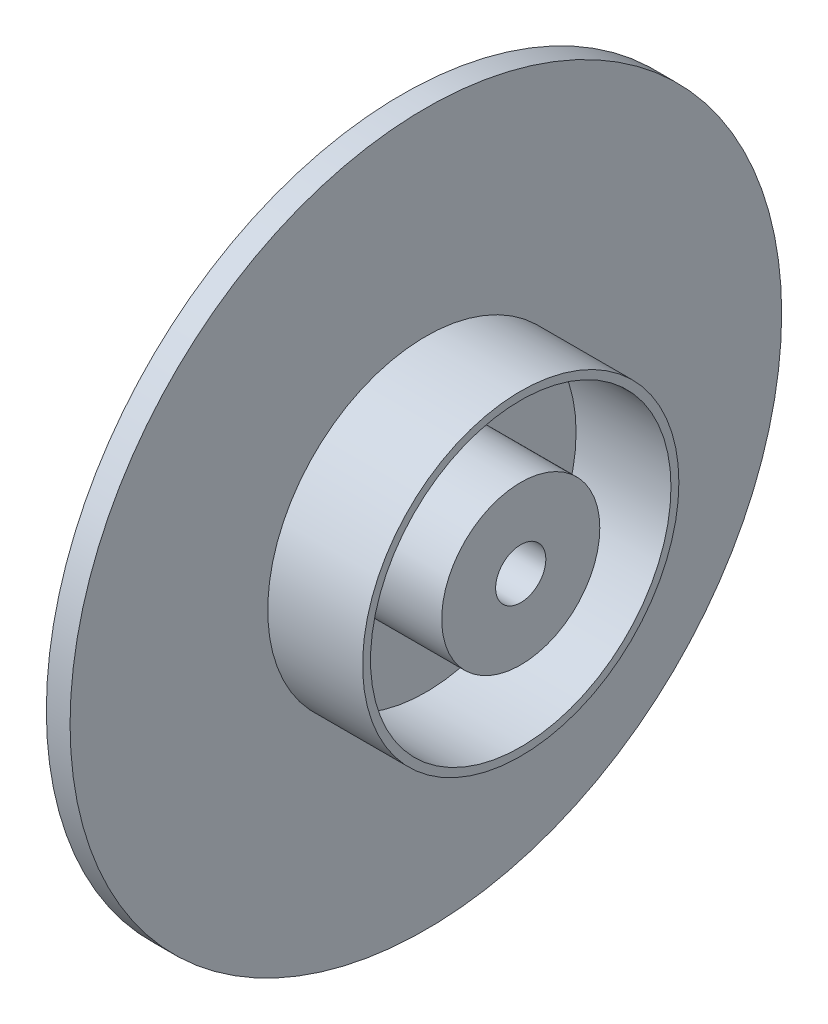
ISO-10303-21;
HEADER;
FILE_DESCRIPTION(('STEP AP214'),'2;1');
FILE_NAME('part.step','',(''),(''),'','','');
FILE_SCHEMA(('AUTOMOTIVE_DESIGN { 1 0 10303 214 1 1 1 1 }'));
ENDSEC;
DATA;
#1=APPLICATION_CONTEXT('core data for automotive mechanical design processes');
#2=APPLICATION_PROTOCOL_DEFINITION('international standard','automotive_design',2000,#1);
#3=PRODUCT_CONTEXT('',#1,'mechanical');
#4=PRODUCT('Part','Part','',(#3));
#5=PRODUCT_RELATED_PRODUCT_CATEGORY('part','',(#4));
#6=PRODUCT_DEFINITION_FORMATION('','',#4);
#7=PRODUCT_DEFINITION_CONTEXT('part definition',#1,'design');
#8=PRODUCT_DEFINITION('design','',#6,#7);
#9=PRODUCT_DEFINITION_SHAPE('','',#8);
#10=(LENGTH_UNIT() NAMED_UNIT(*) SI_UNIT(.MILLI.,.METRE.));
#11=(NAMED_UNIT(*) PLANE_ANGLE_UNIT() SI_UNIT($,.RADIAN.));
#12=(NAMED_UNIT(*) SI_UNIT($,.STERADIAN.) SOLID_ANGLE_UNIT());
#13=UNCERTAINTY_MEASURE_WITH_UNIT(LENGTH_MEASURE(1.E-05),#10,'distance_accuracy_value','');
#14=(GEOMETRIC_REPRESENTATION_CONTEXT(3) GLOBAL_UNCERTAINTY_ASSIGNED_CONTEXT((#13)) GLOBAL_UNIT_ASSIGNED_CONTEXT((#10,
#11,#12)) REPRESENTATION_CONTEXT('',''));
#15=CARTESIAN_POINT('',(0.,0.,0.));
#16=DIRECTION('',(0.,0.,1.));
#17=DIRECTION('',(1.,0.,0.));
#18=AXIS2_PLACEMENT_3D('',#15,#16,#17);
#19=CARTESIAN_POINT('',(3.01133107184446,0.,0.));
#20=DIRECTION('',(-1.,0.,0.));
#21=DIRECTION('',(0.,0.,1.));
#22=AXIS2_PLACEMENT_3D('',#19,#20,#21);
#23=CYLINDRICAL_SURFACE('',#22,27.);
#24=CARTESIAN_POINT('',(3.01133107184446,0.,0.));
#25=DIRECTION('',(1.,0.,0.));
#26=DIRECTION('',(0.,0.,-1.));
#27=AXIS2_PLACEMENT_3D('',#24,#25,#26);
#28=CIRCLE('',#27,27.);
#29=CARTESIAN_POINT('',(3.01133107184446,0.,-27.));
#30=VERTEX_POINT('',#29);
#31=EDGE_CURVE('E45',#30,#30,#28,.T.);
#32=ORIENTED_EDGE('',*,*,#31,.F.);
#33=EDGE_LOOP('',(#32));
#34=FACE_BOUND('',#33,.T.);
#35=CARTESIAN_POINT('',(1.21133107184446,0.,0.));
#36=DIRECTION('',(1.,0.,0.));
#37=DIRECTION('',(0.,0.,-1.));
#38=AXIS2_PLACEMENT_3D('',#35,#36,#37);
#39=CIRCLE('',#38,27.);
#40=CARTESIAN_POINT('',(1.21133107184446,0.,-27.));
#41=VERTEX_POINT('',#40);
#42=EDGE_CURVE('E51',#41,#41,#39,.T.);
#43=ORIENTED_EDGE('',*,*,#42,.T.);
#44=EDGE_LOOP('',(#43));
#45=FACE_BOUND('',#44,.T.);
#46=ADVANCED_FACE('F38',(#34,#45),#23,.T.);
#47=CARTESIAN_POINT('',(3.01133107184446,0.,0.));
#48=DIRECTION('',(1.,0.,0.));
#49=DIRECTION('',(0.,0.,-1.));
#50=AXIS2_PLACEMENT_3D('',#47,#48,#49);
#51=PLANE('',#50);
#52=CARTESIAN_POINT('',(3.01133107184446,0.,0.));
#53=DIRECTION('',(1.,0.,0.));
#54=DIRECTION('',(0.,0.,-1.));
#55=AXIS2_PLACEMENT_3D('',#52,#53,#54);
#56=CIRCLE('',#55,12.);
#57=CARTESIAN_POINT('',(3.01133107184446,0.,-12.));
#58=VERTEX_POINT('',#57);
#59=EDGE_CURVE('E66',#58,#58,#56,.T.);
#60=ORIENTED_EDGE('',*,*,#59,.F.);
#61=EDGE_LOOP('',(#60));
#62=FACE_BOUND('',#61,.T.);
#63=ORIENTED_EDGE('',*,*,#31,.T.);
#64=EDGE_LOOP('',(#63));
#65=FACE_BOUND('',#64,.T.);
#66=ADVANCED_FACE('F112',(#62,#65),#51,.T.);
#67=CARTESIAN_POINT('',(1.21133107184446,0.,0.));
#68=DIRECTION('',(1.,0.,0.));
#69=DIRECTION('',(0.,0.,-1.));
#70=AXIS2_PLACEMENT_3D('',#67,#68,#69);
#71=PLANE('',#70);
#72=CARTESIAN_POINT('',(1.21133107184446,0.,0.));
#73=DIRECTION('',(1.,0.,0.));
#74=DIRECTION('',(0.,0.,-1.));
#75=AXIS2_PLACEMENT_3D('',#72,#73,#74);
#76=CIRCLE('',#75,1.905);
#77=CARTESIAN_POINT('',(1.21133107184446,0.,-1.905));
#78=VERTEX_POINT('',#77);
#79=EDGE_CURVE('E77',#78,#78,#76,.T.);
#80=ORIENTED_EDGE('',*,*,#79,.T.);
#81=EDGE_LOOP('',(#80));
#82=FACE_BOUND('',#81,.T.);
#83=ORIENTED_EDGE('',*,*,#42,.F.);
#84=EDGE_LOOP('',(#83));
#85=FACE_BOUND('',#84,.T.);
#86=ADVANCED_FACE('F86',(#82,#85),#71,.F.);
#87=CARTESIAN_POINT('',(10.2113310718445,0.,0.));
#88=DIRECTION('',(1.,0.,0.));
#89=DIRECTION('',(0.,0.,-1.));
#90=AXIS2_PLACEMENT_3D('',#87,#88,#89);
#91=PLANE('',#90);
#92=CARTESIAN_POINT('',(10.2113310718445,0.,0.));
#93=DIRECTION('',(1.,0.,0.));
#94=DIRECTION('',(0.,0.,-1.));
#95=AXIS2_PLACEMENT_3D('',#92,#93,#94);
#96=CIRCLE('',#95,12.);
#97=CARTESIAN_POINT('',(10.2113310718445,0.,-12.));
#98=VERTEX_POINT('',#97);
#99=EDGE_CURVE('E63',#98,#98,#96,.T.);
#100=ORIENTED_EDGE('',*,*,#99,.T.);
#101=EDGE_LOOP('',(#100));
#102=FACE_BOUND('',#101,.T.);
#103=CARTESIAN_POINT('',(10.2113310718445,0.,0.));
#104=DIRECTION('',(1.,0.,0.));
#105=DIRECTION('',(0.,0.,-1.));
#106=AXIS2_PLACEMENT_3D('',#103,#104,#105);
#107=CIRCLE('',#106,11.4);
#108=CARTESIAN_POINT('',(10.2113310718445,0.,-11.4));
#109=VERTEX_POINT('',#108);
#110=EDGE_CURVE('E70',#109,#109,#107,.T.);
#111=ORIENTED_EDGE('',*,*,#110,.F.);
#112=EDGE_LOOP('',(#111));
#113=FACE_BOUND('',#112,.T.);
#114=ADVANCED_FACE('F124',(#102,#113),#91,.T.);
#115=CARTESIAN_POINT('',(10.2113310718445,0.,0.));
#116=DIRECTION('',(-1.,0.,0.));
#117=DIRECTION('',(0.,0.,1.));
#118=AXIS2_PLACEMENT_3D('',#115,#116,#117);
#119=CYLINDRICAL_SURFACE('',#118,12.);
#120=ORIENTED_EDGE('',*,*,#99,.F.);
#121=EDGE_LOOP('',(#120));
#122=FACE_BOUND('',#121,.T.);
#123=ORIENTED_EDGE('',*,*,#59,.T.);
#124=EDGE_LOOP('',(#123));
#125=FACE_BOUND('',#124,.T.);
#126=ADVANCED_FACE('F128',(#122,#125),#119,.T.);
#127=CARTESIAN_POINT('',(10.2113310718445,0.,0.));
#128=DIRECTION('',(-1.,0.,0.));
#129=DIRECTION('',(0.,0.,1.));
#130=AXIS2_PLACEMENT_3D('',#127,#128,#129);
#131=CYLINDRICAL_SURFACE('',#130,11.4);
#132=ORIENTED_EDGE('',*,*,#110,.T.);
#133=EDGE_LOOP('',(#132));
#134=FACE_BOUND('',#133,.T.);
#135=CARTESIAN_POINT('',(3.01133107184446,0.,0.));
#136=DIRECTION('',(1.,0.,0.));
#137=DIRECTION('',(0.,0.,-1.));
#138=AXIS2_PLACEMENT_3D('',#135,#136,#137);
#139=CIRCLE('',#138,11.4);
#140=CARTESIAN_POINT('',(3.01133107184446,0.,-11.4));
#141=VERTEX_POINT('',#140);
#142=EDGE_CURVE('E10',#141,#141,#139,.F.);
#143=ORIENTED_EDGE('',*,*,#142,.T.);
#144=EDGE_LOOP('',(#143));
#145=FACE_BOUND('',#144,.T.);
#146=ADVANCED_FACE('F100',(#134,#145),#131,.F.);
#147=CARTESIAN_POINT('',(10.2113310718445,0.,0.));
#148=DIRECTION('',(1.,0.,0.));
#149=DIRECTION('',(0.,0.,-1.));
#150=AXIS2_PLACEMENT_3D('',#147,#148,#149);
#151=PLANE('',#150);
#152=CARTESIAN_POINT('',(10.2113310718445,0.,0.));
#153=DIRECTION('',(1.,0.,0.));
#154=DIRECTION('',(0.,0.,-1.));
#155=AXIS2_PLACEMENT_3D('',#152,#153,#154);
#156=CIRCLE('',#155,1.905);
#157=CARTESIAN_POINT('',(10.2113310718445,0.,-1.905));
#158=VERTEX_POINT('',#157);
#159=EDGE_CURVE('E78',#158,#158,#156,.T.);
#160=ORIENTED_EDGE('',*,*,#159,.F.);
#161=EDGE_LOOP('',(#160));
#162=FACE_BOUND('',#161,.T.);
#163=CARTESIAN_POINT('',(10.2113310718445,0.,0.));
#164=DIRECTION('',(1.,0.,0.));
#165=DIRECTION('',(0.,0.,-1.));
#166=AXIS2_PLACEMENT_3D('',#163,#164,#165);
#167=CIRCLE('',#166,6.);
#168=CARTESIAN_POINT('',(10.2113310718445,0.,-6.));
#169=VERTEX_POINT('',#168);
#170=EDGE_CURVE('E57',#169,#169,#167,.T.);
#171=ORIENTED_EDGE('',*,*,#170,.T.);
#172=EDGE_LOOP('',(#171));
#173=FACE_BOUND('',#172,.T.);
#174=ADVANCED_FACE('F96',(#162,#173),#151,.T.);
#175=CARTESIAN_POINT('',(10.2113310718445,0.,0.));
#176=DIRECTION('',(-1.,0.,0.));
#177=DIRECTION('',(0.,0.,1.));
#178=AXIS2_PLACEMENT_3D('',#175,#176,#177);
#179=CYLINDRICAL_SURFACE('',#178,6.);
#180=ORIENTED_EDGE('',*,*,#170,.F.);
#181=EDGE_LOOP('',(#180));
#182=FACE_BOUND('',#181,.T.);
#183=CARTESIAN_POINT('',(3.01133107184446,0.,0.));
#184=DIRECTION('',(1.,0.,0.));
#185=DIRECTION('',(0.,0.,-1.));
#186=AXIS2_PLACEMENT_3D('',#183,#184,#185);
#187=CIRCLE('',#186,6.);
#188=CARTESIAN_POINT('',(3.01133107184446,0.,-6.));
#189=VERTEX_POINT('',#188);
#190=EDGE_CURVE('E59',#189,#189,#187,.T.);
#191=ORIENTED_EDGE('',*,*,#190,.T.);
#192=EDGE_LOOP('',(#191));
#193=FACE_BOUND('',#192,.T.);
#194=ADVANCED_FACE('F99',(#182,#193),#179,.T.);
#195=ORIENTED_EDGE('',*,*,#190,.F.);
#196=EDGE_LOOP('',(#195));
#197=FACE_BOUND('',#196,.T.);
#198=ORIENTED_EDGE('',*,*,#142,.F.);
#199=EDGE_LOOP('',(#198));
#200=FACE_BOUND('',#199,.T.);
#201=ADVANCED_FACE('F92',(#197,#200),#51,.T.);
#202=CARTESIAN_POINT('',(1.21133107184446,0.,0.));
#203=DIRECTION('',(1.,0.,0.));
#204=DIRECTION('',(0.,0.,-1.));
#205=AXIS2_PLACEMENT_3D('',#202,#203,#204);
#206=CYLINDRICAL_SURFACE('',#205,1.905);
#207=ORIENTED_EDGE('',*,*,#79,.F.);
#208=EDGE_LOOP('',(#207));
#209=FACE_BOUND('',#208,.T.);
#210=ORIENTED_EDGE('',*,*,#159,.T.);
#211=EDGE_LOOP('',(#210));
#212=FACE_BOUND('',#211,.T.);
#213=ADVANCED_FACE('F89',(#209,#212),#206,.F.);
#214=CLOSED_SHELL('',(#46,#66,#86,#114,#126,#146,#174,#194,#201,#213));
#215=MANIFOLD_SOLID_BREP('B2',#214);
#216=ADVANCED_BREP_SHAPE_REPRESENTATION('',(#18,#215),#14);
#217=SHAPE_DEFINITION_REPRESENTATION(#9,#216);
ENDSEC;
END-ISO-10303-21;
